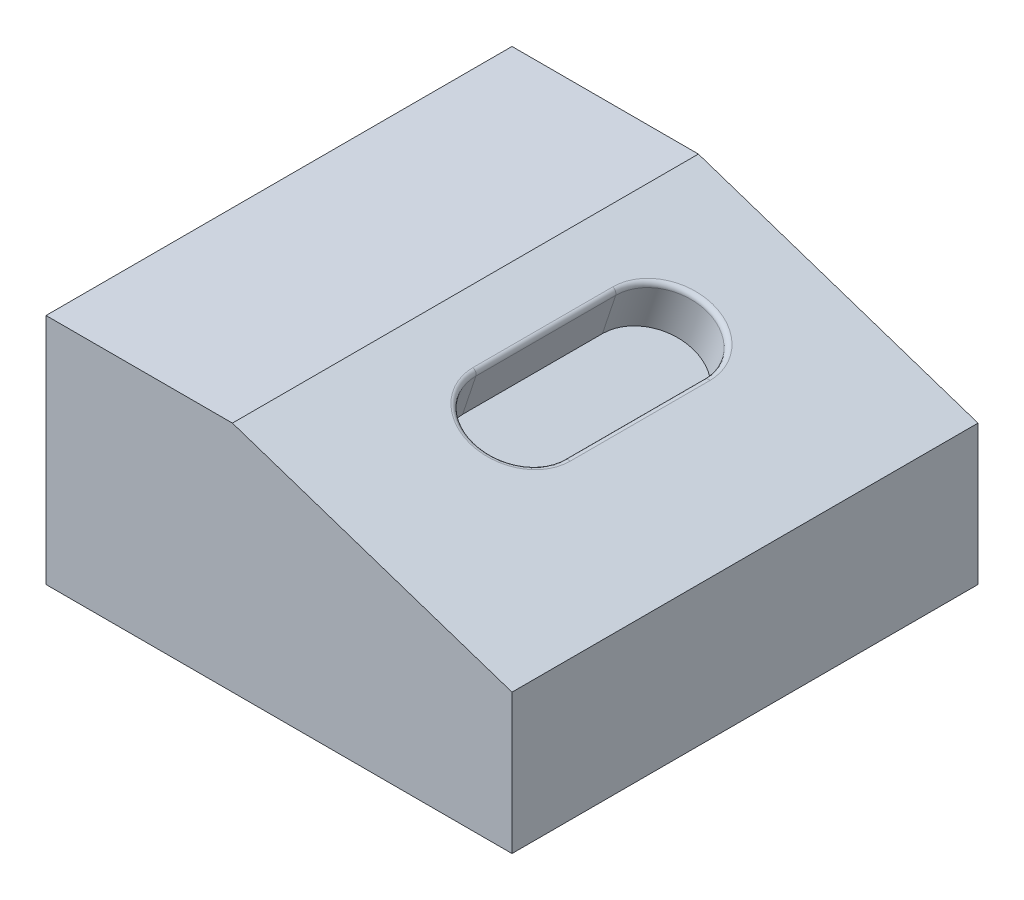
ISO-10303-21;
HEADER;
FILE_DESCRIPTION(('STEP AP214'),'2;1');
FILE_NAME('part.step','',(''),(''),'','','');
FILE_SCHEMA(('AUTOMOTIVE_DESIGN { 1 0 10303 214 1 1 1 1 }'));
ENDSEC;
DATA;
#1=APPLICATION_CONTEXT('core data for automotive mechanical design processes');
#2=APPLICATION_PROTOCOL_DEFINITION('international standard','automotive_design',2000,#1);
#3=PRODUCT_CONTEXT('',#1,'mechanical');
#4=PRODUCT('Part','Part','',(#3));
#5=PRODUCT_RELATED_PRODUCT_CATEGORY('part','',(#4));
#6=PRODUCT_DEFINITION_FORMATION('','',#4);
#7=PRODUCT_DEFINITION_CONTEXT('part definition',#1,'design');
#8=PRODUCT_DEFINITION('design','',#6,#7);
#9=PRODUCT_DEFINITION_SHAPE('','',#8);
#10=(LENGTH_UNIT() NAMED_UNIT(*) SI_UNIT(.MILLI.,.METRE.));
#11=(NAMED_UNIT(*) PLANE_ANGLE_UNIT() SI_UNIT($,.RADIAN.));
#12=(NAMED_UNIT(*) SI_UNIT($,.STERADIAN.) SOLID_ANGLE_UNIT());
#13=UNCERTAINTY_MEASURE_WITH_UNIT(LENGTH_MEASURE(1.E-05),#10,'distance_accuracy_value','');
#14=(GEOMETRIC_REPRESENTATION_CONTEXT(3) GLOBAL_UNCERTAINTY_ASSIGNED_CONTEXT((#13)) GLOBAL_UNIT_ASSIGNED_CONTEXT((#10,
#11,#12)) REPRESENTATION_CONTEXT('',''));
#15=CARTESIAN_POINT('',(0.,0.,0.));
#16=DIRECTION('',(0.,0.,1.));
#17=DIRECTION('',(1.,0.,0.));
#18=AXIS2_PLACEMENT_3D('',#15,#16,#17);
#19=CARTESIAN_POINT('',(0.,0.,50.));
#20=DIRECTION('',(0.,1.,0.));
#21=DIRECTION('',(0.,0.,1.));
#22=AXIS2_PLACEMENT_3D('',#19,#20,#21);
#23=PLANE('',#22);
#24=DIRECTION('',(1.,0.,0.));
#25=VECTOR('',#24,1.);
#26=CARTESIAN_POINT('',(0.,0.,0.));
#27=LINE('',#26,#25);
#28=CARTESIAN_POINT('',(0.,0.,0.));
#29=VERTEX_POINT('',#28);
#30=CARTESIAN_POINT('',(50.,0.,0.));
#31=VERTEX_POINT('',#30);
#32=EDGE_CURVE('E158',#29,#31,#27,.T.);
#33=ORIENTED_EDGE('',*,*,#32,.T.);
#34=DIRECTION('',(0.,0.,-1.));
#35=VECTOR('',#34,1.);
#36=CARTESIAN_POINT('',(50.,0.,50.));
#37=LINE('',#36,#35);
#38=CARTESIAN_POINT('',(50.,0.,50.));
#39=VERTEX_POINT('',#38);
#40=EDGE_CURVE('E195',#39,#31,#37,.T.);
#41=ORIENTED_EDGE('',*,*,#40,.F.);
#42=DIRECTION('',(1.,0.,0.));
#43=VECTOR('',#42,1.);
#44=CARTESIAN_POINT('',(0.,0.,50.));
#45=LINE('',#44,#43);
#46=CARTESIAN_POINT('',(0.,0.,50.));
#47=VERTEX_POINT('',#46);
#48=EDGE_CURVE('E162',#47,#39,#45,.T.);
#49=ORIENTED_EDGE('',*,*,#48,.F.);
#50=DIRECTION('',(0.,0.,-1.));
#51=VECTOR('',#50,1.);
#52=CARTESIAN_POINT('',(0.,0.,50.));
#53=LINE('',#52,#51);
#54=EDGE_CURVE('E174',#47,#29,#53,.T.);
#55=ORIENTED_EDGE('',*,*,#54,.T.);
#56=EDGE_LOOP('',(#33,#41,#49,#55));
#57=FACE_BOUND('',#56,.T.);
#58=ADVANCED_FACE('F43',(#57),#23,.F.);
#59=CARTESIAN_POINT('',(50.,15.,50.));
#60=DIRECTION('',(-1.,0.,0.));
#61=DIRECTION('',(0.,0.,1.));
#62=AXIS2_PLACEMENT_3D('',#59,#60,#61);
#63=PLANE('',#62);
#64=DIRECTION('',(0.,1.,0.));
#65=VECTOR('',#64,1.);
#66=CARTESIAN_POINT('',(50.,15.,0.));
#67=LINE('',#66,#65);
#68=CARTESIAN_POINT('',(50.,15.,0.));
#69=VERTEX_POINT('',#68);
#70=EDGE_CURVE('E177',#31,#69,#67,.T.);
#71=ORIENTED_EDGE('',*,*,#70,.T.);
#72=DIRECTION('',(0.,0.,-1.));
#73=VECTOR('',#72,1.);
#74=CARTESIAN_POINT('',(50.,15.,50.));
#75=LINE('',#74,#73);
#76=CARTESIAN_POINT('',(50.,15.,50.));
#77=VERTEX_POINT('',#76);
#78=EDGE_CURVE('E192',#77,#69,#75,.T.);
#79=ORIENTED_EDGE('',*,*,#78,.F.);
#80=DIRECTION('',(0.,1.,0.));
#81=VECTOR('',#80,1.);
#82=CARTESIAN_POINT('',(50.,15.,50.));
#83=LINE('',#82,#81);
#84=EDGE_CURVE('E165',#39,#77,#83,.T.);
#85=ORIENTED_EDGE('',*,*,#84,.F.);
#86=ORIENTED_EDGE('',*,*,#40,.T.);
#87=EDGE_LOOP('',(#71,#79,#85,#86));
#88=FACE_BOUND('',#87,.T.);
#89=ADVANCED_FACE('F243',(#88),#63,.F.);
#90=CARTESIAN_POINT('',(20.,25.,50.));
#91=DIRECTION('',(-0.316227766016838,-0.948683298050514,0.));
#92=DIRECTION('',(0.948683298050514,-0.316227766016838,0.));
#93=AXIS2_PLACEMENT_3D('',#90,#91,#92);
#94=PLANE('',#93);
#95=CARTESIAN_POINT('',(31.0263340389897,21.3245553203368,30.));
#96=DIRECTION('',(-0.316227766016838,-0.948683298050514,0.));
#97=DIRECTION('',(0.948683298050514,-0.316227766016838,0.));
#98=AXIS2_PLACEMENT_3D('',#95,#96,#97);
#99=CIRCLE('',#98,5.5);
#100=CARTESIAN_POINT('',(36.2440921782676,19.5853026072441,30.));
#101=VERTEX_POINT('',#100);
#102=CARTESIAN_POINT('',(25.8085758997119,23.0638080334294,30.));
#103=VERTEX_POINT('',#102);
#104=EDGE_CURVE('E200',#101,#103,#99,.T.);
#105=ORIENTED_EDGE('',*,*,#104,.T.);
#106=DIRECTION('',(0.,0.,1.));
#107=VECTOR('',#106,1.);
#108=CARTESIAN_POINT('',(25.8085758997119,23.0638080334294,50.));
#109=LINE('',#108,#107);
#110=CARTESIAN_POINT('',(25.8085758997119,23.0638080334294,15.));
#111=VERTEX_POINT('',#110);
#112=EDGE_CURVE('E206',#103,#111,#109,.F.);
#113=ORIENTED_EDGE('',*,*,#112,.T.);
#114=CARTESIAN_POINT('',(31.0263340389897,21.3245553203368,15.));
#115=DIRECTION('',(-0.316227766016838,-0.948683298050514,0.));
#116=DIRECTION('',(0.948683298050514,-0.316227766016838,0.));
#117=AXIS2_PLACEMENT_3D('',#114,#115,#116);
#118=CIRCLE('',#117,5.5);
#119=CARTESIAN_POINT('',(36.2440921782676,19.5853026072441,15.));
#120=VERTEX_POINT('',#119);
#121=EDGE_CURVE('E204',#111,#120,#118,.T.);
#122=ORIENTED_EDGE('',*,*,#121,.T.);
#123=DIRECTION('',(0.,0.,-1.));
#124=VECTOR('',#123,1.);
#125=CARTESIAN_POINT('',(36.2440921782676,19.5853026072441,50.));
#126=LINE('',#125,#124);
#127=EDGE_CURVE('E202',#120,#101,#126,.F.);
#128=ORIENTED_EDGE('',*,*,#127,.T.);
#129=EDGE_LOOP('',(#105,#113,#122,#128));
#130=FACE_BOUND('',#129,.T.);
#131=DIRECTION('',(-0.948683298050514,0.316227766016838,0.));
#132=VECTOR('',#131,1.);
#133=CARTESIAN_POINT('',(20.,25.,0.));
#134=LINE('',#133,#132);
#135=CARTESIAN_POINT('',(20.,25.,0.));
#136=VERTEX_POINT('',#135);
#137=EDGE_CURVE('E179',#69,#136,#134,.T.);
#138=ORIENTED_EDGE('',*,*,#137,.T.);
#139=DIRECTION('',(0.,0.,-1.));
#140=VECTOR('',#139,1.);
#141=CARTESIAN_POINT('',(20.,25.,50.));
#142=LINE('',#141,#140);
#143=CARTESIAN_POINT('',(20.,25.,50.));
#144=VERTEX_POINT('',#143);
#145=EDGE_CURVE('E189',#144,#136,#142,.T.);
#146=ORIENTED_EDGE('',*,*,#145,.F.);
#147=DIRECTION('',(-0.948683298050514,0.316227766016838,0.));
#148=VECTOR('',#147,1.);
#149=CARTESIAN_POINT('',(20.,25.,50.));
#150=LINE('',#149,#148);
#151=EDGE_CURVE('E168',#77,#144,#150,.T.);
#152=ORIENTED_EDGE('',*,*,#151,.F.);
#153=ORIENTED_EDGE('',*,*,#78,.T.);
#154=EDGE_LOOP('',(#138,#146,#152,#153));
#155=FACE_BOUND('',#154,.T.);
#156=ADVANCED_FACE('F249',(#130,#155),#94,.F.);
#157=CARTESIAN_POINT('',(0.,25.,50.));
#158=DIRECTION('',(0.,-1.,0.));
#159=DIRECTION('',(0.,0.,-1.));
#160=AXIS2_PLACEMENT_3D('',#157,#158,#159);
#161=PLANE('',#160);
#162=DIRECTION('',(-1.,0.,0.));
#163=VECTOR('',#162,1.);
#164=CARTESIAN_POINT('',(0.,25.,0.));
#165=LINE('',#164,#163);
#166=CARTESIAN_POINT('',(0.,25.,0.));
#167=VERTEX_POINT('',#166);
#168=EDGE_CURVE('E181',#136,#167,#165,.T.);
#169=ORIENTED_EDGE('',*,*,#168,.T.);
#170=DIRECTION('',(0.,0.,-1.));
#171=VECTOR('',#170,1.);
#172=CARTESIAN_POINT('',(0.,25.,50.));
#173=LINE('',#172,#171);
#174=CARTESIAN_POINT('',(0.,25.,50.));
#175=VERTEX_POINT('',#174);
#176=EDGE_CURVE('E186',#175,#167,#173,.T.);
#177=ORIENTED_EDGE('',*,*,#176,.F.);
#178=DIRECTION('',(-1.,0.,0.));
#179=VECTOR('',#178,1.);
#180=CARTESIAN_POINT('',(0.,25.,50.));
#181=LINE('',#180,#179);
#182=EDGE_CURVE('E170',#144,#175,#181,.T.);
#183=ORIENTED_EDGE('',*,*,#182,.F.);
#184=ORIENTED_EDGE('',*,*,#145,.T.);
#185=EDGE_LOOP('',(#169,#177,#183,#184));
#186=FACE_BOUND('',#185,.T.);
#187=ADVANCED_FACE('F281',(#186),#161,.F.);
#188=CARTESIAN_POINT('',(0.,0.,50.));
#189=DIRECTION('',(1.,0.,0.));
#190=DIRECTION('',(0.,0.,-1.));
#191=AXIS2_PLACEMENT_3D('',#188,#189,#190);
#192=PLANE('',#191);
#193=DIRECTION('',(0.,-1.,0.));
#194=VECTOR('',#193,1.);
#195=CARTESIAN_POINT('',(0.,0.,0.));
#196=LINE('',#195,#194);
#197=EDGE_CURVE('E166',#167,#29,#196,.T.);
#198=ORIENTED_EDGE('',*,*,#197,.T.);
#199=ORIENTED_EDGE('',*,*,#54,.F.);
#200=DIRECTION('',(0.,-1.,0.));
#201=VECTOR('',#200,1.);
#202=CARTESIAN_POINT('',(0.,0.,50.));
#203=LINE('',#202,#201);
#204=EDGE_CURVE('E172',#175,#47,#203,.T.);
#205=ORIENTED_EDGE('',*,*,#204,.F.);
#206=ORIENTED_EDGE('',*,*,#176,.T.);
#207=EDGE_LOOP('',(#198,#199,#205,#206));
#208=FACE_BOUND('',#207,.T.);
#209=ADVANCED_FACE('F274',(#208),#192,.F.);
#210=CARTESIAN_POINT('',(0.,0.,50.));
#211=DIRECTION('',(0.,0.,-1.));
#212=DIRECTION('',(-1.,0.,0.));
#213=AXIS2_PLACEMENT_3D('',#210,#211,#212);
#214=PLANE('',#213);
#215=ORIENTED_EDGE('',*,*,#48,.T.);
#216=ORIENTED_EDGE('',*,*,#84,.T.);
#217=ORIENTED_EDGE('',*,*,#151,.T.);
#218=ORIENTED_EDGE('',*,*,#182,.T.);
#219=ORIENTED_EDGE('',*,*,#204,.T.);
#220=EDGE_LOOP('',(#215,#216,#217,#218,#219));
#221=FACE_BOUND('',#220,.T.);
#222=ADVANCED_FACE('F271',(#221),#214,.F.);
#223=CARTESIAN_POINT('',(0.,0.,0.));
#224=DIRECTION('',(0.,0.,-1.));
#225=DIRECTION('',(-1.,0.,0.));
#226=AXIS2_PLACEMENT_3D('',#223,#224,#225);
#227=PLANE('',#226);
#228=ORIENTED_EDGE('',*,*,#32,.F.);
#229=ORIENTED_EDGE('',*,*,#197,.F.);
#230=ORIENTED_EDGE('',*,*,#168,.F.);
#231=ORIENTED_EDGE('',*,*,#137,.F.);
#232=ORIENTED_EDGE('',*,*,#70,.F.);
#233=EDGE_LOOP('',(#228,#229,#230,#231,#232));
#234=FACE_BOUND('',#233,.T.);
#235=ADVANCED_FACE('F239',(#234),#227,.T.);
#236=CARTESIAN_POINT('',(29.4451952089055,16.5811388300842,15.));
#237=DIRECTION('',(0.316227766016838,0.948683298050514,0.));
#238=DIRECTION('',(-0.948683298050514,0.316227766016838,0.));
#239=AXIS2_PLACEMENT_3D('',#236,#237,#238);
#240=CYLINDRICAL_SURFACE('',#239,5.);
#241=DIRECTION('',(0.316227766016838,0.948683298050514,0.));
#242=VECTOR('',#241,1.);
#243=CARTESIAN_POINT('',(34.1886116991581,15.,15.));
#244=LINE('',#243,#242);
#245=CARTESIAN_POINT('',(34.1886116991581,15.,15.));
#246=VERTEX_POINT('',#245);
#247=CARTESIAN_POINT('',(35.6116366462339,19.2690748412273,15.));
#248=VERTEX_POINT('',#247);
#249=EDGE_CURVE('E156',#246,#248,#244,.T.);
#250=ORIENTED_EDGE('',*,*,#249,.T.);
#251=CARTESIAN_POINT('',(30.8682201559813,20.8502136713115,15.));
#252=DIRECTION('',(-0.316227766016838,-0.948683298050514,0.));
#253=DIRECTION('',(0.948683298050514,-0.316227766016838,0.));
#254=AXIS2_PLACEMENT_3D('',#251,#252,#253);
#255=CIRCLE('',#254,5.);
#256=CARTESIAN_POINT('',(26.1248036657287,22.4313525013957,15.));
#257=VERTEX_POINT('',#256);
#258=EDGE_CURVE('E133',#248,#257,#255,.F.);
#259=ORIENTED_EDGE('',*,*,#258,.T.);
#260=DIRECTION('',(0.316227766016838,0.948683298050514,0.));
#261=VECTOR('',#260,1.);
#262=CARTESIAN_POINT('',(24.701778718653,18.1622776601684,15.));
#263=LINE('',#262,#261);
#264=CARTESIAN_POINT('',(24.701778718653,18.1622776601684,15.));
#265=VERTEX_POINT('',#264);
#266=EDGE_CURVE('E126',#265,#257,#263,.T.);
#267=ORIENTED_EDGE('',*,*,#266,.F.);
#268=CARTESIAN_POINT('',(29.4451952089055,16.5811388300842,15.));
#269=DIRECTION('',(0.316227766016838,0.948683298050514,0.));
#270=DIRECTION('',(-0.948683298050514,0.316227766016838,0.));
#271=AXIS2_PLACEMENT_3D('',#268,#269,#270);
#272=CIRCLE('',#271,5.);
#273=EDGE_CURVE('E130',#246,#265,#272,.T.);
#274=ORIENTED_EDGE('',*,*,#273,.F.);
#275=EDGE_LOOP('',(#250,#259,#267,#274));
#276=FACE_BOUND('',#275,.T.);
#277=ADVANCED_FACE('F128',(#276),#240,.F.);
#278=CARTESIAN_POINT('',(34.1886116991581,15.,15.));
#279=DIRECTION('',(0.948683298050514,-0.316227766016838,0.));
#280=DIRECTION('',(0.316227766016838,0.948683298050514,0.));
#281=AXIS2_PLACEMENT_3D('',#278,#279,#280);
#282=PLANE('',#281);
#283=DIRECTION('',(0.316227766016838,0.948683298050514,0.));
#284=VECTOR('',#283,1.);
#285=CARTESIAN_POINT('',(34.1886116991581,15.,30.));
#286=LINE('',#285,#284);
#287=CARTESIAN_POINT('',(34.1886116991581,15.,30.));
#288=VERTEX_POINT('',#287);
#289=CARTESIAN_POINT('',(35.6116366462339,19.2690748412273,30.));
#290=VERTEX_POINT('',#289);
#291=EDGE_CURVE('E159',#288,#290,#286,.T.);
#292=ORIENTED_EDGE('',*,*,#291,.T.);
#293=DIRECTION('',(0.,0.,-1.));
#294=VECTOR('',#293,1.);
#295=CARTESIAN_POINT('',(35.6116366462339,19.2690748412273,15.));
#296=LINE('',#295,#294);
#297=EDGE_CURVE('E52',#290,#248,#296,.T.);
#298=ORIENTED_EDGE('',*,*,#297,.T.);
#299=ORIENTED_EDGE('',*,*,#249,.F.);
#300=DIRECTION('',(0.,0.,-1.));
#301=VECTOR('',#300,1.);
#302=CARTESIAN_POINT('',(34.1886116991581,15.,15.));
#303=LINE('',#302,#301);
#304=EDGE_CURVE('E138',#288,#246,#303,.T.);
#305=ORIENTED_EDGE('',*,*,#304,.F.);
#306=EDGE_LOOP('',(#292,#298,#299,#305));
#307=FACE_BOUND('',#306,.T.);
#308=ADVANCED_FACE('F231',(#307),#282,.F.);
#309=CARTESIAN_POINT('',(29.4451952089055,16.5811388300842,30.));
#310=DIRECTION('',(0.316227766016838,0.948683298050514,0.));
#311=DIRECTION('',(-0.948683298050514,0.316227766016838,0.));
#312=AXIS2_PLACEMENT_3D('',#309,#310,#311);
#313=CYLINDRICAL_SURFACE('',#312,5.);
#314=DIRECTION('',(0.316227766016838,0.948683298050514,0.));
#315=VECTOR('',#314,1.);
#316=CARTESIAN_POINT('',(24.701778718653,18.1622776601684,30.));
#317=LINE('',#316,#315);
#318=CARTESIAN_POINT('',(24.701778718653,18.1622776601684,30.));
#319=VERTEX_POINT('',#318);
#320=CARTESIAN_POINT('',(26.1248036657287,22.4313525013957,30.));
#321=VERTEX_POINT('',#320);
#322=EDGE_CURVE('E137',#319,#321,#317,.T.);
#323=ORIENTED_EDGE('',*,*,#322,.T.);
#324=CARTESIAN_POINT('',(30.8682201559813,20.8502136713115,30.));
#325=DIRECTION('',(-0.316227766016838,-0.948683298050514,0.));
#326=DIRECTION('',(0.948683298050514,-0.316227766016838,0.));
#327=AXIS2_PLACEMENT_3D('',#324,#325,#326);
#328=CIRCLE('',#327,5.);
#329=EDGE_CURVE('E11',#321,#290,#328,.F.);
#330=ORIENTED_EDGE('',*,*,#329,.T.);
#331=ORIENTED_EDGE('',*,*,#291,.F.);
#332=CARTESIAN_POINT('',(29.4451952089055,16.5811388300842,30.));
#333=DIRECTION('',(0.316227766016838,0.948683298050514,0.));
#334=DIRECTION('',(-0.948683298050514,0.316227766016838,0.));
#335=AXIS2_PLACEMENT_3D('',#332,#333,#334);
#336=CIRCLE('',#335,5.);
#337=EDGE_CURVE('E146',#319,#288,#336,.T.);
#338=ORIENTED_EDGE('',*,*,#337,.F.);
#339=EDGE_LOOP('',(#323,#330,#331,#338));
#340=FACE_BOUND('',#339,.T.);
#341=ADVANCED_FACE('F230',(#340),#313,.F.);
#342=CARTESIAN_POINT('',(24.701778718653,18.1622776601684,15.));
#343=DIRECTION('',(-0.948683298050514,0.316227766016838,0.));
#344=DIRECTION('',(-0.316227766016838,-0.948683298050514,0.));
#345=AXIS2_PLACEMENT_3D('',#342,#343,#344);
#346=PLANE('',#345);
#347=ORIENTED_EDGE('',*,*,#266,.T.);
#348=DIRECTION('',(0.,0.,1.));
#349=VECTOR('',#348,1.);
#350=CARTESIAN_POINT('',(26.1248036657287,22.4313525013957,15.));
#351=LINE('',#350,#349);
#352=EDGE_CURVE('E198',#257,#321,#351,.T.);
#353=ORIENTED_EDGE('',*,*,#352,.T.);
#354=ORIENTED_EDGE('',*,*,#322,.F.);
#355=DIRECTION('',(0.,0.,1.));
#356=VECTOR('',#355,1.);
#357=CARTESIAN_POINT('',(24.701778718653,18.1622776601684,15.));
#358=LINE('',#357,#356);
#359=EDGE_CURVE('E141',#265,#319,#358,.T.);
#360=ORIENTED_EDGE('',*,*,#359,.F.);
#361=EDGE_LOOP('',(#347,#353,#354,#360));
#362=FACE_BOUND('',#361,.T.);
#363=ADVANCED_FACE('F142',(#362),#346,.F.);
#364=CARTESIAN_POINT('',(29.4451952089055,16.5811388300842,15.));
#365=DIRECTION('',(0.316227766016838,0.948683298050514,0.));
#366=DIRECTION('',(-0.948683298050514,0.316227766016838,0.));
#367=AXIS2_PLACEMENT_3D('',#364,#365,#366);
#368=PLANE('',#367);
#369=ORIENTED_EDGE('',*,*,#273,.T.);
#370=ORIENTED_EDGE('',*,*,#359,.T.);
#371=ORIENTED_EDGE('',*,*,#337,.T.);
#372=ORIENTED_EDGE('',*,*,#304,.T.);
#373=EDGE_LOOP('',(#369,#370,#371,#372));
#374=FACE_BOUND('',#373,.T.);
#375=ADVANCED_FACE('F148',(#374),#368,.T.);
#376=CARTESIAN_POINT('',(36.0859782952591,19.1109609582189,15.));
#377=DIRECTION('',(0.,0.,-1.));
#378=DIRECTION('',(-1.,0.,0.));
#379=AXIS2_PLACEMENT_3D('',#376,#377,#378);
#380=CYLINDRICAL_SURFACE('',#379,0.5);
#381=CARTESIAN_POINT('',(36.0859782952591,19.1109609582189,30.));
#382=DIRECTION('',(0.,0.,1.));
#383=DIRECTION('',(1.,0.,0.));
#384=AXIS2_PLACEMENT_3D('',#381,#382,#383);
#385=CIRCLE('',#384,0.5);
#386=EDGE_CURVE('E152',#101,#290,#385,.T.);
#387=ORIENTED_EDGE('',*,*,#386,.F.);
#388=ORIENTED_EDGE('',*,*,#127,.F.);
#389=CARTESIAN_POINT('',(36.0859782952591,19.1109609582189,15.));
#390=DIRECTION('',(0.,0.,-1.));
#391=DIRECTION('',(-1.,0.,0.));
#392=AXIS2_PLACEMENT_3D('',#389,#390,#391);
#393=CIRCLE('',#392,0.5);
#394=EDGE_CURVE('E47',#248,#120,#393,.T.);
#395=ORIENTED_EDGE('',*,*,#394,.F.);
#396=ORIENTED_EDGE('',*,*,#297,.F.);
#397=EDGE_LOOP('',(#387,#388,#395,#396));
#398=FACE_BOUND('',#397,.T.);
#399=ADVANCED_FACE('F45',(#398),#380,.T.);
#400=CARTESIAN_POINT('',(30.8682201559813,20.8502136713115,15.));
#401=DIRECTION('',(-0.316227766016838,-0.948683298050514,0.));
#402=DIRECTION('',(0.948683298050514,-0.316227766016838,0.));
#403=AXIS2_PLACEMENT_3D('',#400,#401,#402);
#404=TOROIDAL_SURFACE('',#403,5.5,0.5);
#405=ORIENTED_EDGE('',*,*,#394,.T.);
#406=ORIENTED_EDGE('',*,*,#121,.F.);
#407=CARTESIAN_POINT('',(25.6504620167035,22.5894663844041,15.));
#408=DIRECTION('',(0.,0.,1.));
#409=DIRECTION('',(1.,0.,0.));
#410=AXIS2_PLACEMENT_3D('',#407,#408,#409);
#411=CIRCLE('',#410,0.5);
#412=EDGE_CURVE('E213',#257,#111,#411,.T.);
#413=ORIENTED_EDGE('',*,*,#412,.F.);
#414=ORIENTED_EDGE('',*,*,#258,.F.);
#415=EDGE_LOOP('',(#405,#406,#413,#414));
#416=FACE_BOUND('',#415,.T.);
#417=ADVANCED_FACE('F225',(#416),#404,.T.);
#418=CARTESIAN_POINT('',(30.8682201559813,20.8502136713115,30.));
#419=DIRECTION('',(-0.316227766016838,-0.948683298050514,0.));
#420=DIRECTION('',(0.948683298050514,-0.316227766016838,0.));
#421=AXIS2_PLACEMENT_3D('',#418,#419,#420);
#422=TOROIDAL_SURFACE('',#421,5.5,0.5);
#423=ORIENTED_EDGE('',*,*,#386,.T.);
#424=ORIENTED_EDGE('',*,*,#329,.F.);
#425=CARTESIAN_POINT('',(25.6504620167035,22.5894663844041,30.));
#426=DIRECTION('',(0.,0.,-1.));
#427=DIRECTION('',(-1.,0.,0.));
#428=AXIS2_PLACEMENT_3D('',#425,#426,#427);
#429=CIRCLE('',#428,0.5);
#430=EDGE_CURVE('E211',#103,#321,#429,.T.);
#431=ORIENTED_EDGE('',*,*,#430,.F.);
#432=ORIENTED_EDGE('',*,*,#104,.F.);
#433=EDGE_LOOP('',(#423,#424,#431,#432));
#434=FACE_BOUND('',#433,.T.);
#435=ADVANCED_FACE('F218',(#434),#422,.T.);
#436=CARTESIAN_POINT('',(25.6504620167035,22.5894663844041,15.));
#437=DIRECTION('',(0.,0.,1.));
#438=DIRECTION('',(1.,0.,0.));
#439=AXIS2_PLACEMENT_3D('',#436,#437,#438);
#440=CYLINDRICAL_SURFACE('',#439,0.5);
#441=ORIENTED_EDGE('',*,*,#412,.T.);
#442=ORIENTED_EDGE('',*,*,#112,.F.);
#443=ORIENTED_EDGE('',*,*,#430,.T.);
#444=ORIENTED_EDGE('',*,*,#352,.F.);
#445=EDGE_LOOP('',(#441,#442,#443,#444));
#446=FACE_BOUND('',#445,.T.);
#447=ADVANCED_FACE('F229',(#446),#440,.T.);
#448=CLOSED_SHELL('',(#58,#89,#156,#187,#209,#222,#235,#277,#308,#341,#363,#375,#399,#417,#435,#447));
#449=MANIFOLD_SOLID_BREP('B2',#448);
#450=ADVANCED_BREP_SHAPE_REPRESENTATION('',(#18,#449),#14);
#451=SHAPE_DEFINITION_REPRESENTATION(#9,#450);
ENDSEC;
END-ISO-10303-21;
